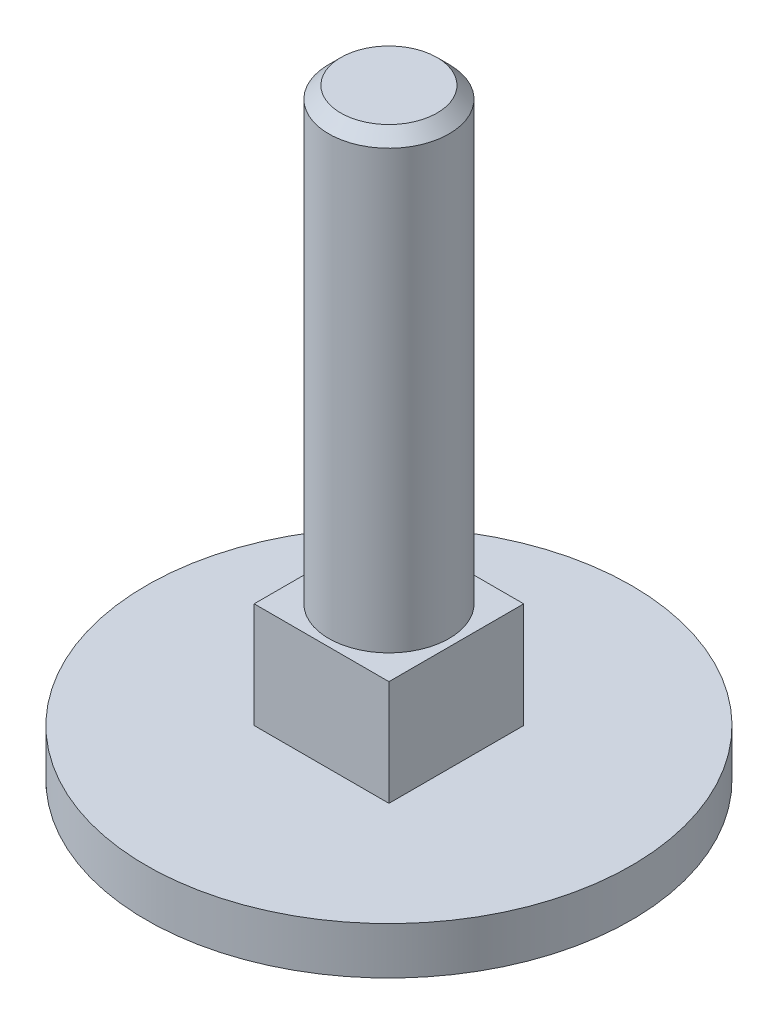
ISO-10303-21;
HEADER;
FILE_DESCRIPTION(('STEP AP214'),'2;1');
FILE_NAME('part.step','',(''),(''),'','','');
FILE_SCHEMA(('AUTOMOTIVE_DESIGN { 1 0 10303 214 1 1 1 1 }'));
ENDSEC;
DATA;
#1=APPLICATION_CONTEXT('core data for automotive mechanical design processes');
#2=APPLICATION_PROTOCOL_DEFINITION('international standard','automotive_design',2000,#1);
#3=PRODUCT_CONTEXT('',#1,'mechanical');
#4=PRODUCT('Part','Part','',(#3));
#5=PRODUCT_RELATED_PRODUCT_CATEGORY('part','',(#4));
#6=PRODUCT_DEFINITION_FORMATION('','',#4);
#7=PRODUCT_DEFINITION_CONTEXT('part definition',#1,'design');
#8=PRODUCT_DEFINITION('design','',#6,#7);
#9=PRODUCT_DEFINITION_SHAPE('','',#8);
#10=(LENGTH_UNIT() NAMED_UNIT(*) SI_UNIT(.MILLI.,.METRE.));
#11=(NAMED_UNIT(*) PLANE_ANGLE_UNIT() SI_UNIT($,.RADIAN.));
#12=(NAMED_UNIT(*) SI_UNIT($,.STERADIAN.) SOLID_ANGLE_UNIT());
#13=UNCERTAINTY_MEASURE_WITH_UNIT(LENGTH_MEASURE(1.E-05),#10,'distance_accuracy_value','');
#14=(GEOMETRIC_REPRESENTATION_CONTEXT(3) GLOBAL_UNCERTAINTY_ASSIGNED_CONTEXT((#13)) GLOBAL_UNIT_ASSIGNED_CONTEXT((#10,
#11,#12)) REPRESENTATION_CONTEXT('',''));
#15=CARTESIAN_POINT('',(0.,0.,0.));
#16=DIRECTION('',(0.,0.,1.));
#17=DIRECTION('',(1.,0.,0.));
#18=AXIS2_PLACEMENT_3D('',#15,#16,#17);
#19=CARTESIAN_POINT('',(-2.57048,31.75,-2.57048));
#20=DIRECTION('',(0.,1.,0.));
#21=DIRECTION('',(0.,0.,1.));
#22=AXIS2_PLACEMENT_3D('',#19,#20,#21);
#23=PLANE('',#22);
#24=CARTESIAN_POINT('',(0.,31.7499999999999,0.));
#25=DIRECTION('',(0.,-1.,0.));
#26=DIRECTION('',(0.,0.,-1.));
#27=AXIS2_PLACEMENT_3D('',#24,#25,#26);
#28=CIRCLE('',#27,2.54000000000006);
#29=CARTESIAN_POINT('',(0.,31.7499999999999,-2.54000000000006));
#30=VERTEX_POINT('',#29);
#31=EDGE_CURVE('E21',#30,#30,#28,.F.);
#32=ORIENTED_EDGE('',*,*,#31,.T.);
#33=EDGE_LOOP('',(#32));
#34=FACE_BOUND('',#33,.T.);
#35=ADVANCED_FACE('F17',(#34),#23,.T.);
#36=CARTESIAN_POINT('',(0.,31.75,0.));
#37=DIRECTION('',(0.,-1.,0.));
#38=DIRECTION('',(0.,0.,-1.));
#39=AXIS2_PLACEMENT_3D('',#36,#37,#38);
#40=CONICAL_SURFACE('',#39,2.54,0.785398163397451);
#41=CARTESIAN_POINT('',(0.,31.115,0.));
#42=DIRECTION('',(0.,-1.,0.));
#43=DIRECTION('',(0.,0.,-1.));
#44=AXIS2_PLACEMENT_3D('',#41,#42,#43);
#45=CIRCLE('',#44,3.175);
#46=CARTESIAN_POINT('',(0.,31.115,-3.175));
#47=VERTEX_POINT('',#46);
#48=EDGE_CURVE('E84',#47,#47,#45,.F.);
#49=ORIENTED_EDGE('',*,*,#48,.T.);
#50=EDGE_LOOP('',(#49));
#51=FACE_BOUND('',#50,.T.);
#52=ORIENTED_EDGE('',*,*,#31,.F.);
#53=EDGE_LOOP('',(#52));
#54=FACE_BOUND('',#53,.T.);
#55=ADVANCED_FACE('F95',(#51,#54),#40,.T.);
#56=CARTESIAN_POINT('',(0.,31.115,0.));
#57=DIRECTION('',(0.,-1.,0.));
#58=DIRECTION('',(0.,0.,-1.));
#59=AXIS2_PLACEMENT_3D('',#56,#57,#58);
#60=CYLINDRICAL_SURFACE('',#59,3.175);
#61=ORIENTED_EDGE('',*,*,#48,.F.);
#62=EDGE_LOOP('',(#61));
#63=FACE_BOUND('',#62,.T.);
#64=CARTESIAN_POINT('',(0.,8.0518,0.));
#65=DIRECTION('',(0.,-1.,0.));
#66=DIRECTION('',(0.,0.,-1.));
#67=AXIS2_PLACEMENT_3D('',#64,#65,#66);
#68=CIRCLE('',#67,3.175);
#69=CARTESIAN_POINT('',(0.,8.0518,-3.175));
#70=VERTEX_POINT('',#69);
#71=EDGE_CURVE('E70',#70,#70,#68,.T.);
#72=ORIENTED_EDGE('',*,*,#71,.F.);
#73=EDGE_LOOP('',(#72));
#74=FACE_BOUND('',#73,.T.);
#75=ADVANCED_FACE('F93',(#63,#74),#60,.T.);
#76=CARTESIAN_POINT('',(-3.556,8.0518,-3.556));
#77=DIRECTION('',(0.,1.,0.));
#78=DIRECTION('',(0.,0.,1.));
#79=AXIS2_PLACEMENT_3D('',#76,#77,#78);
#80=PLANE('',#79);
#81=ORIENTED_EDGE('',*,*,#71,.T.);
#82=EDGE_LOOP('',(#81));
#83=FACE_BOUND('',#82,.T.);
#84=DIRECTION('',(1.,0.,0.));
#85=VECTOR('',#84,1.);
#86=CARTESIAN_POINT('',(0.,8.0518,3.556));
#87=LINE('',#86,#85);
#88=CARTESIAN_POINT('',(-3.556,8.0518,3.556));
#89=VERTEX_POINT('',#88);
#90=CARTESIAN_POINT('',(3.556,8.0518,3.556));
#91=VERTEX_POINT('',#90);
#92=EDGE_CURVE('E56',#89,#91,#87,.T.);
#93=ORIENTED_EDGE('',*,*,#92,.T.);
#94=DIRECTION('',(0.,0.,-1.));
#95=VECTOR('',#94,1.);
#96=CARTESIAN_POINT('',(3.556,8.0518,0.));
#97=LINE('',#96,#95);
#98=CARTESIAN_POINT('',(3.556,8.0518,-3.556));
#99=VERTEX_POINT('',#98);
#100=EDGE_CURVE('E61',#91,#99,#97,.T.);
#101=ORIENTED_EDGE('',*,*,#100,.T.);
#102=DIRECTION('',(-1.,0.,0.));
#103=VECTOR('',#102,1.);
#104=CARTESIAN_POINT('',(0.,8.0518,-3.556));
#105=LINE('',#104,#103);
#106=CARTESIAN_POINT('',(-3.556,8.0518,-3.556));
#107=VERTEX_POINT('',#106);
#108=EDGE_CURVE('E210',#99,#107,#105,.T.);
#109=ORIENTED_EDGE('',*,*,#108,.T.);
#110=DIRECTION('',(0.,0.,1.));
#111=VECTOR('',#110,1.);
#112=CARTESIAN_POINT('',(-3.556,8.0518,0.));
#113=LINE('',#112,#111);
#114=EDGE_CURVE('E73',#107,#89,#113,.T.);
#115=ORIENTED_EDGE('',*,*,#114,.T.);
#116=EDGE_LOOP('',(#93,#101,#109,#115));
#117=FACE_BOUND('',#116,.T.);
#118=ADVANCED_FACE('F72',(#83,#117),#80,.T.);
#119=CARTESIAN_POINT('',(3.556,2.4892,-3.556));
#120=DIRECTION('',(-1.,0.,0.));
#121=DIRECTION('',(0.,0.,1.));
#122=AXIS2_PLACEMENT_3D('',#119,#120,#121);
#123=PLANE('',#122);
#124=DIRECTION('',(0.,-1.,0.));
#125=VECTOR('',#124,1.);
#126=CARTESIAN_POINT('',(3.556,5.2705,3.556));
#127=LINE('',#126,#125);
#128=CARTESIAN_POINT('',(3.55599999955906,2.4892,3.55599999955906));
#129=VERTEX_POINT('',#128);
#130=EDGE_CURVE('E63',#91,#129,#127,.T.);
#131=ORIENTED_EDGE('',*,*,#130,.T.);
#132=DIRECTION('',(0.,0.,1.));
#133=VECTOR('',#132,1.);
#134=CARTESIAN_POINT('',(3.55599999823623,2.4892,0.));
#135=LINE('',#134,#133);
#136=CARTESIAN_POINT('',(3.55599999955906,2.4892,-3.55599999955905));
#137=VERTEX_POINT('',#136);
#138=EDGE_CURVE('E212',#137,#129,#135,.T.);
#139=ORIENTED_EDGE('',*,*,#138,.F.);
#140=DIRECTION('',(0.,1.,0.));
#141=VECTOR('',#140,1.);
#142=CARTESIAN_POINT('',(3.556,5.2705,-3.556));
#143=LINE('',#142,#141);
#144=EDGE_CURVE('E66',#137,#99,#143,.T.);
#145=ORIENTED_EDGE('',*,*,#144,.T.);
#146=ORIENTED_EDGE('',*,*,#100,.F.);
#147=EDGE_LOOP('',(#131,#139,#145,#146));
#148=FACE_BOUND('',#147,.T.);
#149=ADVANCED_FACE('F62',(#148),#123,.F.);
#150=CARTESIAN_POINT('',(3.556,2.4892,3.556));
#151=DIRECTION('',(0.,0.,-1.));
#152=DIRECTION('',(-1.,0.,0.));
#153=AXIS2_PLACEMENT_3D('',#150,#151,#152);
#154=PLANE('',#153);
#155=DIRECTION('',(0.,-1.,0.));
#156=VECTOR('',#155,1.);
#157=CARTESIAN_POINT('',(-3.556,5.2705,3.556));
#158=LINE('',#157,#156);
#159=CARTESIAN_POINT('',(-3.55599999955906,2.4892,3.55599999955906));
#160=VERTEX_POINT('',#159);
#161=EDGE_CURVE('E75',#89,#160,#158,.T.);
#162=ORIENTED_EDGE('',*,*,#161,.T.);
#163=DIRECTION('',(-1.,0.,0.));
#164=VECTOR('',#163,1.);
#165=CARTESIAN_POINT('',(0.,2.4892,3.55599999823623));
#166=LINE('',#165,#164);
#167=EDGE_CURVE('E79',#129,#160,#166,.T.);
#168=ORIENTED_EDGE('',*,*,#167,.F.);
#169=ORIENTED_EDGE('',*,*,#130,.F.);
#170=ORIENTED_EDGE('',*,*,#92,.F.);
#171=EDGE_LOOP('',(#162,#168,#169,#170));
#172=FACE_BOUND('',#171,.T.);
#173=ADVANCED_FACE('F77',(#172),#154,.F.);
#174=CARTESIAN_POINT('',(-3.556,2.4892,3.556));
#175=DIRECTION('',(1.,0.,0.));
#176=DIRECTION('',(0.,0.,-1.));
#177=AXIS2_PLACEMENT_3D('',#174,#175,#176);
#178=PLANE('',#177);
#179=DIRECTION('',(0.,-1.,0.));
#180=VECTOR('',#179,1.);
#181=CARTESIAN_POINT('',(-3.556,5.2705,-3.556));
#182=LINE('',#181,#180);
#183=CARTESIAN_POINT('',(-3.55599999955905,2.4892,-3.55599999955906));
#184=VERTEX_POINT('',#183);
#185=EDGE_CURVE('E36',#107,#184,#182,.T.);
#186=ORIENTED_EDGE('',*,*,#185,.T.);
#187=DIRECTION('',(0.,0.,-1.));
#188=VECTOR('',#187,1.);
#189=CARTESIAN_POINT('',(-3.55599999823622,2.4892,0.));
#190=LINE('',#189,#188);
#191=EDGE_CURVE('E213',#160,#184,#190,.T.);
#192=ORIENTED_EDGE('',*,*,#191,.F.);
#193=ORIENTED_EDGE('',*,*,#161,.F.);
#194=ORIENTED_EDGE('',*,*,#114,.F.);
#195=EDGE_LOOP('',(#186,#192,#193,#194));
#196=FACE_BOUND('',#195,.T.);
#197=ADVANCED_FACE('F126',(#196),#178,.F.);
#198=CARTESIAN_POINT('',(-3.556,2.4892,-3.556));
#199=DIRECTION('',(0.,0.,1.));
#200=DIRECTION('',(1.,0.,0.));
#201=AXIS2_PLACEMENT_3D('',#198,#199,#200);
#202=PLANE('',#201);
#203=ORIENTED_EDGE('',*,*,#144,.F.);
#204=DIRECTION('',(1.,0.,0.));
#205=VECTOR('',#204,1.);
#206=CARTESIAN_POINT('',(0.,2.4892,-3.55599999823622));
#207=LINE('',#206,#205);
#208=EDGE_CURVE('E88',#184,#137,#207,.T.);
#209=ORIENTED_EDGE('',*,*,#208,.F.);
#210=ORIENTED_EDGE('',*,*,#185,.F.);
#211=ORIENTED_EDGE('',*,*,#108,.F.);
#212=EDGE_LOOP('',(#203,#209,#210,#211));
#213=FACE_BOUND('',#212,.T.);
#214=ADVANCED_FACE('F122',(#213),#202,.F.);
#215=CARTESIAN_POINT('',(-12.9552192,0.,-12.9552192));
#216=DIRECTION('',(0.,1.,0.));
#217=DIRECTION('',(0.,0.,1.));
#218=AXIS2_PLACEMENT_3D('',#215,#216,#217);
#219=PLANE('',#218);
#220=CARTESIAN_POINT('',(0.,0.,0.));
#221=DIRECTION('',(0.,-1.,0.));
#222=DIRECTION('',(0.,0.,-1.));
#223=AXIS2_PLACEMENT_3D('',#220,#221,#222);
#224=CIRCLE('',#223,12.8016);
#225=CARTESIAN_POINT('',(0.,0.,-12.8016));
#226=VERTEX_POINT('',#225);
#227=EDGE_CURVE('E27',#226,#226,#224,.T.);
#228=ORIENTED_EDGE('',*,*,#227,.T.);
#229=EDGE_LOOP('',(#228));
#230=FACE_BOUND('',#229,.T.);
#231=ADVANCED_FACE('F114',(#230),#219,.F.);
#232=CARTESIAN_POINT('',(-12.9552192,2.4892,-12.9552192));
#233=DIRECTION('',(0.,1.,0.));
#234=DIRECTION('',(0.,0.,1.));
#235=AXIS2_PLACEMENT_3D('',#232,#233,#234);
#236=PLANE('',#235);
#237=ORIENTED_EDGE('',*,*,#191,.T.);
#238=ORIENTED_EDGE('',*,*,#208,.T.);
#239=ORIENTED_EDGE('',*,*,#138,.T.);
#240=ORIENTED_EDGE('',*,*,#167,.T.);
#241=EDGE_LOOP('',(#237,#238,#239,#240));
#242=FACE_BOUND('',#241,.T.);
#243=CARTESIAN_POINT('',(0.,2.4892,0.));
#244=DIRECTION('',(0.,-1.,0.));
#245=DIRECTION('',(0.,0.,-1.));
#246=AXIS2_PLACEMENT_3D('',#243,#244,#245);
#247=CIRCLE('',#246,12.8016);
#248=CARTESIAN_POINT('',(0.,2.4892,-12.8016));
#249=VERTEX_POINT('',#248);
#250=EDGE_CURVE('E11',#249,#249,#247,.F.);
#251=ORIENTED_EDGE('',*,*,#250,.T.);
#252=EDGE_LOOP('',(#251));
#253=FACE_BOUND('',#252,.T.);
#254=ADVANCED_FACE('F19',(#242,#253),#236,.T.);
#255=CARTESIAN_POINT('',(0.,2.4892,0.));
#256=DIRECTION('',(0.,-1.,0.));
#257=DIRECTION('',(0.,0.,-1.));
#258=AXIS2_PLACEMENT_3D('',#255,#256,#257);
#259=CYLINDRICAL_SURFACE('',#258,12.8016);
#260=ORIENTED_EDGE('',*,*,#227,.F.);
#261=EDGE_LOOP('',(#260));
#262=FACE_BOUND('',#261,.T.);
#263=ORIENTED_EDGE('',*,*,#250,.F.);
#264=EDGE_LOOP('',(#263));
#265=FACE_BOUND('',#264,.T.);
#266=ADVANCED_FACE('F108',(#262,#265),#259,.T.);
#267=CLOSED_SHELL('',(#35,#55,#75,#118,#149,#173,#197,#214,#231,#254,#266));
#268=MANIFOLD_SOLID_BREP('B1',#267);
#269=ADVANCED_BREP_SHAPE_REPRESENTATION('',(#18,#268),#14);
#270=SHAPE_DEFINITION_REPRESENTATION(#9,#269);
ENDSEC;
END-ISO-10303-21;
